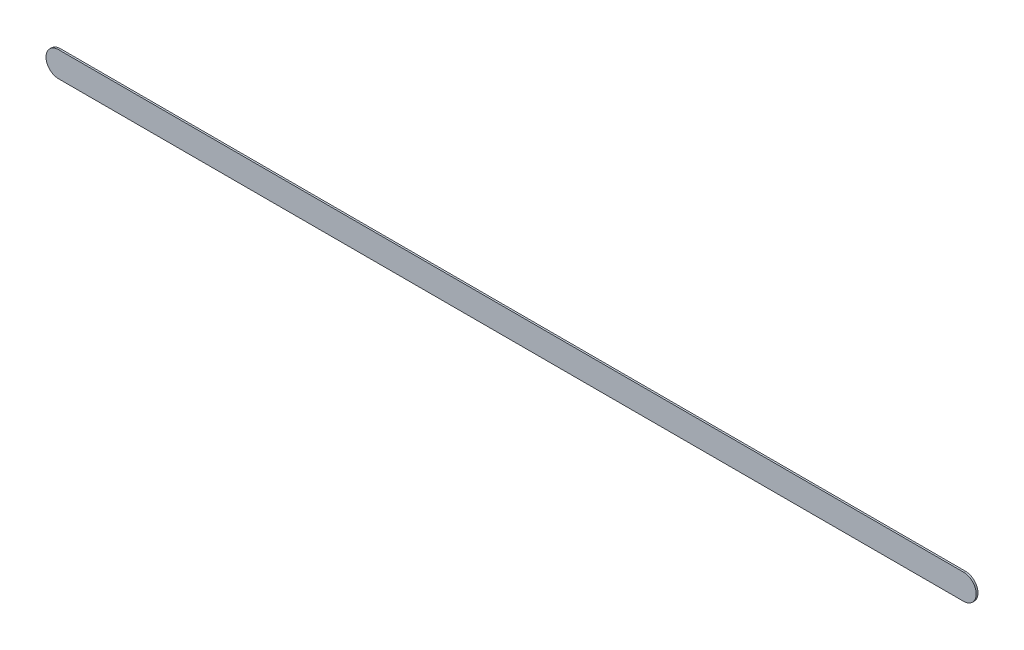
ISO-10303-21;
HEADER;
FILE_DESCRIPTION(('STEP AP214'),'2;1');
FILE_NAME('part.step','',(''),(''),'','','');
FILE_SCHEMA(('AUTOMOTIVE_DESIGN { 1 0 10303 214 1 1 1 1 }'));
ENDSEC;
DATA;
#1=APPLICATION_CONTEXT('core data for automotive mechanical design processes');
#2=APPLICATION_PROTOCOL_DEFINITION('international standard','automotive_design',2000,#1);
#3=PRODUCT_CONTEXT('',#1,'mechanical');
#4=PRODUCT('Part','Part','',(#3));
#5=PRODUCT_RELATED_PRODUCT_CATEGORY('part','',(#4));
#6=PRODUCT_DEFINITION_FORMATION('','',#4);
#7=PRODUCT_DEFINITION_CONTEXT('part definition',#1,'design');
#8=PRODUCT_DEFINITION('design','',#6,#7);
#9=PRODUCT_DEFINITION_SHAPE('','',#8);
#10=(LENGTH_UNIT() NAMED_UNIT(*) SI_UNIT(.MILLI.,.METRE.));
#11=(NAMED_UNIT(*) PLANE_ANGLE_UNIT() SI_UNIT($,.RADIAN.));
#12=(NAMED_UNIT(*) SI_UNIT($,.STERADIAN.) SOLID_ANGLE_UNIT());
#13=UNCERTAINTY_MEASURE_WITH_UNIT(LENGTH_MEASURE(1.E-05),#10,'distance_accuracy_value','');
#14=(GEOMETRIC_REPRESENTATION_CONTEXT(3) GLOBAL_UNCERTAINTY_ASSIGNED_CONTEXT((#13)) GLOBAL_UNIT_ASSIGNED_CONTEXT((#10,
#11,#12)) REPRESENTATION_CONTEXT('',''));
#15=CARTESIAN_POINT('',(0.,0.,0.));
#16=DIRECTION('',(0.,0.,1.));
#17=DIRECTION('',(1.,0.,0.));
#18=AXIS2_PLACEMENT_3D('',#15,#16,#17);
#19=CARTESIAN_POINT('',(141.981,-115.955,0.));
#20=DIRECTION('',(0.,0.,1.));
#21=DIRECTION('',(1.,0.,0.));
#22=AXIS2_PLACEMENT_3D('',#19,#20,#21);
#23=PLANE('',#22);
#24=DIRECTION('',(-1.,0.,0.));
#25=VECTOR('',#24,1.);
#26=CARTESIAN_POINT('',(141.981,-115.955,0.));
#27=LINE('',#26,#25);
#28=CARTESIAN_POINT('',(141.981,-115.955,0.));
#29=VERTEX_POINT('',#28);
#30=CARTESIAN_POINT('',(124.079,-115.955,0.));
#31=VERTEX_POINT('',#30);
#32=EDGE_CURVE('E82',#29,#31,#27,.T.);
#33=ORIENTED_EDGE('',*,*,#32,.T.);
#34=CARTESIAN_POINT('',(124.079,-116.205,0.));
#35=DIRECTION('',(0.,0.,1.));
#36=DIRECTION('',(0.,1.,0.));
#37=AXIS2_PLACEMENT_3D('',#34,#35,#36);
#38=CIRCLE('',#37,0.25);
#39=CARTESIAN_POINT('',(124.079,-116.455,0.));
#40=VERTEX_POINT('',#39);
#41=EDGE_CURVE('E109',#31,#40,#38,.T.);
#42=ORIENTED_EDGE('',*,*,#41,.T.);
#43=DIRECTION('',(1.,0.,0.));
#44=VECTOR('',#43,1.);
#45=CARTESIAN_POINT('',(124.079,-116.455,0.));
#46=LINE('',#45,#44);
#47=CARTESIAN_POINT('',(141.981,-116.455,0.));
#48=VERTEX_POINT('',#47);
#49=EDGE_CURVE('E75',#40,#48,#46,.T.);
#50=ORIENTED_EDGE('',*,*,#49,.T.);
#51=CARTESIAN_POINT('',(141.981,-116.205,0.));
#52=DIRECTION('',(0.,0.,1.));
#53=DIRECTION('',(0.,-1.,0.));
#54=AXIS2_PLACEMENT_3D('',#51,#52,#53);
#55=CIRCLE('',#54,0.25);
#56=EDGE_CURVE('E11',#48,#29,#55,.T.);
#57=ORIENTED_EDGE('',*,*,#56,.T.);
#58=EDGE_LOOP('',(#33,#42,#50,#57));
#59=FACE_BOUND('',#58,.T.);
#60=ADVANCED_FACE('F17',(#59),#23,.T.);
#61=CARTESIAN_POINT('',(141.981,-115.955,-0.035));
#62=DIRECTION('',(0.,0.,1.));
#63=DIRECTION('',(1.,0.,0.));
#64=AXIS2_PLACEMENT_3D('',#61,#62,#63);
#65=PLANE('',#64);
#66=CARTESIAN_POINT('',(141.981,-116.205,-0.035));
#67=DIRECTION('',(0.,0.,1.));
#68=DIRECTION('',(0.,-1.,0.));
#69=AXIS2_PLACEMENT_3D('',#66,#67,#68);
#70=CIRCLE('',#69,0.25);
#71=CARTESIAN_POINT('',(141.981,-116.455,-0.035));
#72=VERTEX_POINT('',#71);
#73=CARTESIAN_POINT('',(141.981,-115.955,-0.035));
#74=VERTEX_POINT('',#73);
#75=EDGE_CURVE('E20',#72,#74,#70,.T.);
#76=ORIENTED_EDGE('',*,*,#75,.F.);
#77=DIRECTION('',(1.,0.,0.));
#78=VECTOR('',#77,1.);
#79=CARTESIAN_POINT('',(124.079,-116.455,-0.035));
#80=LINE('',#79,#78);
#81=CARTESIAN_POINT('',(124.079,-116.455,-0.035));
#82=VERTEX_POINT('',#81);
#83=EDGE_CURVE('E104',#82,#72,#80,.T.);
#84=ORIENTED_EDGE('',*,*,#83,.F.);
#85=CARTESIAN_POINT('',(124.079,-116.205,-0.035));
#86=DIRECTION('',(0.,0.,1.));
#87=DIRECTION('',(0.,1.,0.));
#88=AXIS2_PLACEMENT_3D('',#85,#86,#87);
#89=CIRCLE('',#88,0.25);
#90=CARTESIAN_POINT('',(124.079,-115.955,-0.035));
#91=VERTEX_POINT('',#90);
#92=EDGE_CURVE('E84',#91,#82,#89,.T.);
#93=ORIENTED_EDGE('',*,*,#92,.F.);
#94=DIRECTION('',(-1.,0.,0.));
#95=VECTOR('',#94,1.);
#96=CARTESIAN_POINT('',(141.981,-115.955,-0.035));
#97=LINE('',#96,#95);
#98=EDGE_CURVE('E80',#74,#91,#97,.T.);
#99=ORIENTED_EDGE('',*,*,#98,.F.);
#100=EDGE_LOOP('',(#76,#84,#93,#99));
#101=FACE_BOUND('',#100,.T.);
#102=ADVANCED_FACE('F86',(#101),#65,.F.);
#103=CARTESIAN_POINT('',(141.981,-116.205,-0.035));
#104=DIRECTION('',(0.,0.,-1.));
#105=DIRECTION('',(0.,-1.,0.));
#106=AXIS2_PLACEMENT_3D('',#103,#104,#105);
#107=CYLINDRICAL_SURFACE('',#106,0.25);
#108=ORIENTED_EDGE('',*,*,#75,.T.);
#109=DIRECTION('',(0.,0.,1.));
#110=VECTOR('',#109,1.);
#111=CARTESIAN_POINT('',(141.981,-115.955,-0.035));
#112=LINE('',#111,#110);
#113=EDGE_CURVE('E69',#74,#29,#112,.T.);
#114=ORIENTED_EDGE('',*,*,#113,.T.);
#115=ORIENTED_EDGE('',*,*,#56,.F.);
#116=DIRECTION('',(0.,0.,1.));
#117=VECTOR('',#116,1.);
#118=CARTESIAN_POINT('',(141.981,-116.455,-0.035));
#119=LINE('',#118,#117);
#120=EDGE_CURVE('E72',#72,#48,#119,.T.);
#121=ORIENTED_EDGE('',*,*,#120,.F.);
#122=EDGE_LOOP('',(#108,#114,#115,#121));
#123=FACE_BOUND('',#122,.T.);
#124=ADVANCED_FACE('F68',(#123),#107,.T.);
#125=CARTESIAN_POINT('',(124.079,-116.455,-0.035));
#126=DIRECTION('',(0.,1.,0.));
#127=DIRECTION('',(1.,0.,0.));
#128=AXIS2_PLACEMENT_3D('',#125,#126,#127);
#129=PLANE('',#128);
#130=ORIENTED_EDGE('',*,*,#83,.T.);
#131=ORIENTED_EDGE('',*,*,#120,.T.);
#132=ORIENTED_EDGE('',*,*,#49,.F.);
#133=DIRECTION('',(0.,0.,1.));
#134=VECTOR('',#133,1.);
#135=CARTESIAN_POINT('',(124.079,-116.455,-0.035));
#136=LINE('',#135,#134);
#137=EDGE_CURVE('E99',#82,#40,#136,.T.);
#138=ORIENTED_EDGE('',*,*,#137,.F.);
#139=EDGE_LOOP('',(#130,#131,#132,#138));
#140=FACE_BOUND('',#139,.T.);
#141=ADVANCED_FACE('F120',(#140),#129,.F.);
#142=CARTESIAN_POINT('',(124.079,-116.205,-0.035));
#143=DIRECTION('',(0.,0.,-1.));
#144=DIRECTION('',(0.,1.,0.));
#145=AXIS2_PLACEMENT_3D('',#142,#143,#144);
#146=CYLINDRICAL_SURFACE('',#145,0.25);
#147=ORIENTED_EDGE('',*,*,#92,.T.);
#148=ORIENTED_EDGE('',*,*,#137,.T.);
#149=ORIENTED_EDGE('',*,*,#41,.F.);
#150=DIRECTION('',(0.,0.,1.));
#151=VECTOR('',#150,1.);
#152=CARTESIAN_POINT('',(124.079,-115.955,-0.035));
#153=LINE('',#152,#151);
#154=EDGE_CURVE('E90',#91,#31,#153,.T.);
#155=ORIENTED_EDGE('',*,*,#154,.F.);
#156=EDGE_LOOP('',(#147,#148,#149,#155));
#157=FACE_BOUND('',#156,.T.);
#158=ADVANCED_FACE('F122',(#157),#146,.T.);
#159=CARTESIAN_POINT('',(141.981,-115.955,-0.035));
#160=DIRECTION('',(0.,-1.,0.));
#161=DIRECTION('',(0.,0.,-1.));
#162=AXIS2_PLACEMENT_3D('',#159,#160,#161);
#163=PLANE('',#162);
#164=ORIENTED_EDGE('',*,*,#98,.T.);
#165=ORIENTED_EDGE('',*,*,#154,.T.);
#166=ORIENTED_EDGE('',*,*,#32,.F.);
#167=ORIENTED_EDGE('',*,*,#113,.F.);
#168=EDGE_LOOP('',(#164,#165,#166,#167));
#169=FACE_BOUND('',#168,.T.);
#170=ADVANCED_FACE('F78',(#169),#163,.F.);
#171=CLOSED_SHELL('',(#60,#102,#124,#141,#158,#170));
#172=MANIFOLD_SOLID_BREP('B1',#171);
#173=ADVANCED_BREP_SHAPE_REPRESENTATION('',(#18,#172),#14);
#174=SHAPE_DEFINITION_REPRESENTATION(#9,#173);
ENDSEC;
END-ISO-10303-21;
